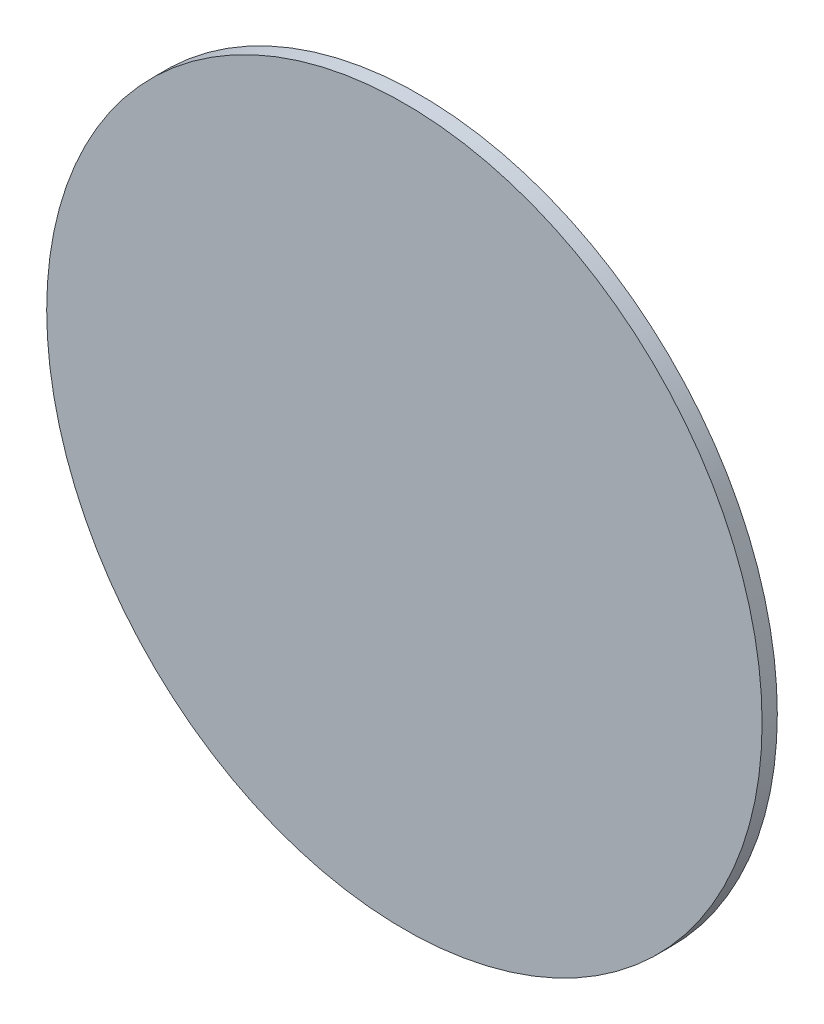
ISO-10303-21;
HEADER;
FILE_DESCRIPTION(('STEP AP214'),'2;1');
FILE_NAME('part.step','',(''),(''),'','','');
FILE_SCHEMA(('AUTOMOTIVE_DESIGN { 1 0 10303 214 1 1 1 1 }'));
ENDSEC;
DATA;
#1=APPLICATION_CONTEXT('core data for automotive mechanical design processes');
#2=APPLICATION_PROTOCOL_DEFINITION('international standard','automotive_design',2000,#1);
#3=PRODUCT_CONTEXT('',#1,'mechanical');
#4=PRODUCT('Part','Part','',(#3));
#5=PRODUCT_RELATED_PRODUCT_CATEGORY('part','',(#4));
#6=PRODUCT_DEFINITION_FORMATION('','',#4);
#7=PRODUCT_DEFINITION_CONTEXT('part definition',#1,'design');
#8=PRODUCT_DEFINITION('design','',#6,#7);
#9=PRODUCT_DEFINITION_SHAPE('','',#8);
#10=(LENGTH_UNIT() NAMED_UNIT(*) SI_UNIT(.MILLI.,.METRE.));
#11=(NAMED_UNIT(*) PLANE_ANGLE_UNIT() SI_UNIT($,.RADIAN.));
#12=(NAMED_UNIT(*) SI_UNIT($,.STERADIAN.) SOLID_ANGLE_UNIT());
#13=UNCERTAINTY_MEASURE_WITH_UNIT(LENGTH_MEASURE(1.E-05),#10,'distance_accuracy_value','');
#14=(GEOMETRIC_REPRESENTATION_CONTEXT(3) GLOBAL_UNCERTAINTY_ASSIGNED_CONTEXT((#13)) GLOBAL_UNIT_ASSIGNED_CONTEXT((#10,
#11,#12)) REPRESENTATION_CONTEXT('',''));
#15=CARTESIAN_POINT('',(0.,0.,0.));
#16=DIRECTION('',(0.,0.,1.));
#17=DIRECTION('',(1.,0.,0.));
#18=AXIS2_PLACEMENT_3D('',#15,#16,#17);
#19=CARTESIAN_POINT('',(0.,0.,0.254));
#20=DIRECTION('',(0.,0.,-1.));
#21=DIRECTION('',(-1.,0.,0.));
#22=AXIS2_PLACEMENT_3D('',#19,#20,#21);
#23=CYLINDRICAL_SURFACE('',#22,5.969);
#24=CARTESIAN_POINT('',(0.,0.,0.254));
#25=DIRECTION('',(0.,0.,1.));
#26=DIRECTION('',(1.,0.,0.));
#27=AXIS2_PLACEMENT_3D('',#24,#25,#26);
#28=CIRCLE('',#27,5.969);
#29=CARTESIAN_POINT('',(5.969,0.,0.254));
#30=VERTEX_POINT('',#29);
#31=EDGE_CURVE('E10',#30,#30,#28,.T.);
#32=ORIENTED_EDGE('',*,*,#31,.F.);
#33=EDGE_LOOP('',(#32));
#34=FACE_BOUND('',#33,.T.);
#35=CARTESIAN_POINT('',(0.,0.,0.));
#36=DIRECTION('',(0.,0.,1.));
#37=DIRECTION('',(1.,0.,0.));
#38=AXIS2_PLACEMENT_3D('',#35,#36,#37);
#39=CIRCLE('',#38,5.969);
#40=CARTESIAN_POINT('',(5.969,0.,0.));
#41=VERTEX_POINT('',#40);
#42=EDGE_CURVE('E38',#41,#41,#39,.T.);
#43=ORIENTED_EDGE('',*,*,#42,.T.);
#44=EDGE_LOOP('',(#43));
#45=FACE_BOUND('',#44,.T.);
#46=ADVANCED_FACE('F35',(#34,#45),#23,.T.);
#47=CARTESIAN_POINT('',(0.,0.,0.254));
#48=DIRECTION('',(0.,0.,1.));
#49=DIRECTION('',(1.,0.,0.));
#50=AXIS2_PLACEMENT_3D('',#47,#48,#49);
#51=PLANE('',#50);
#52=ORIENTED_EDGE('',*,*,#31,.T.);
#53=EDGE_LOOP('',(#52));
#54=FACE_BOUND('',#53,.T.);
#55=ADVANCED_FACE('F50',(#54),#51,.T.);
#56=CARTESIAN_POINT('',(0.,0.,0.));
#57=DIRECTION('',(0.,0.,1.));
#58=DIRECTION('',(1.,0.,0.));
#59=AXIS2_PLACEMENT_3D('',#56,#57,#58);
#60=PLANE('',#59);
#61=ORIENTED_EDGE('',*,*,#42,.F.);
#62=EDGE_LOOP('',(#61));
#63=FACE_BOUND('',#62,.T.);
#64=ADVANCED_FACE('F48',(#63),#60,.F.);
#65=CLOSED_SHELL('',(#46,#55,#64));
#66=MANIFOLD_SOLID_BREP('B2',#65);
#67=ADVANCED_BREP_SHAPE_REPRESENTATION('',(#18,#66),#14);
#68=SHAPE_DEFINITION_REPRESENTATION(#9,#67);
ENDSEC;
END-ISO-10303-21;
